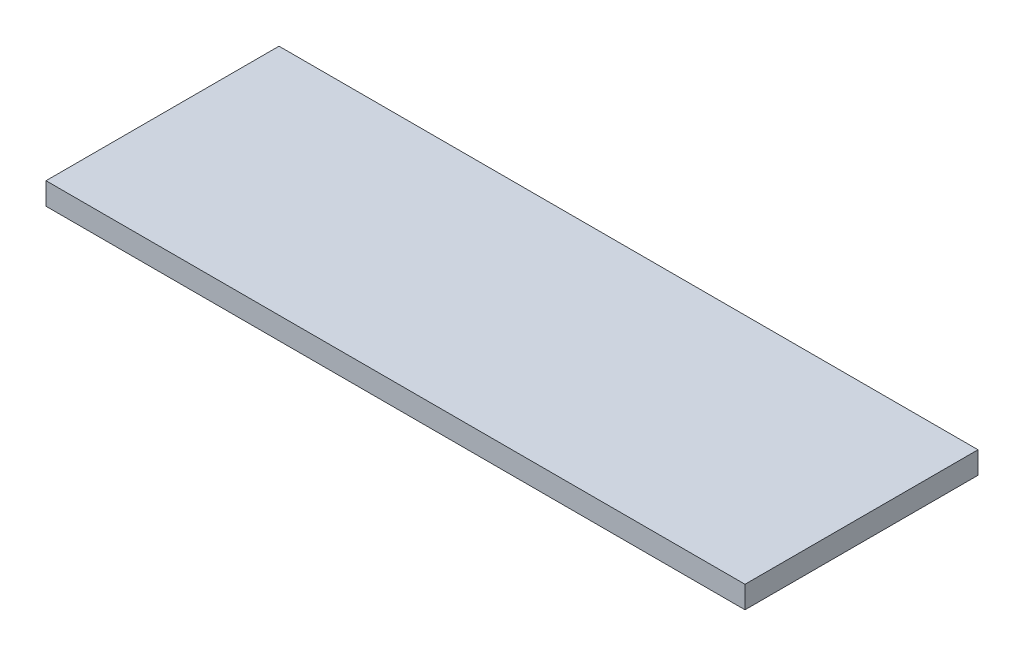
ISO-10303-21;
HEADER;
FILE_DESCRIPTION(('STEP AP214'),'2;1');
FILE_NAME('part.step','',(''),(''),'','','');
FILE_SCHEMA(('AUTOMOTIVE_DESIGN { 1 0 10303 214 1 1 1 1 }'));
ENDSEC;
DATA;
#1=APPLICATION_CONTEXT('core data for automotive mechanical design processes');
#2=APPLICATION_PROTOCOL_DEFINITION('international standard','automotive_design',2000,#1);
#3=PRODUCT_CONTEXT('',#1,'mechanical');
#4=PRODUCT('Part','Part','',(#3));
#5=PRODUCT_RELATED_PRODUCT_CATEGORY('part','',(#4));
#6=PRODUCT_DEFINITION_FORMATION('','',#4);
#7=PRODUCT_DEFINITION_CONTEXT('part definition',#1,'design');
#8=PRODUCT_DEFINITION('design','',#6,#7);
#9=PRODUCT_DEFINITION_SHAPE('','',#8);
#10=(LENGTH_UNIT() NAMED_UNIT(*) SI_UNIT(.MILLI.,.METRE.));
#11=(NAMED_UNIT(*) PLANE_ANGLE_UNIT() SI_UNIT($,.RADIAN.));
#12=(NAMED_UNIT(*) SI_UNIT($,.STERADIAN.) SOLID_ANGLE_UNIT());
#13=UNCERTAINTY_MEASURE_WITH_UNIT(LENGTH_MEASURE(1.E-05),#10,'distance_accuracy_value','');
#14=(GEOMETRIC_REPRESENTATION_CONTEXT(3) GLOBAL_UNCERTAINTY_ASSIGNED_CONTEXT((#13)) GLOBAL_UNIT_ASSIGNED_CONTEXT((#10,
#11,#12)) REPRESENTATION_CONTEXT('',''));
#15=CARTESIAN_POINT('',(0.,0.,0.));
#16=DIRECTION('',(0.,0.,1.));
#17=DIRECTION('',(1.,0.,0.));
#18=AXIS2_PLACEMENT_3D('',#15,#16,#17);
#19=CARTESIAN_POINT('',(-30.,1.9,-10.));
#20=DIRECTION('',(1.,0.,0.));
#21=DIRECTION('',(0.,0.,-1.));
#22=AXIS2_PLACEMENT_3D('',#19,#20,#21);
#23=PLANE('',#22);
#24=DIRECTION('',(0.,0.,1.));
#25=VECTOR('',#24,1.);
#26=CARTESIAN_POINT('',(-30.,0.,-10.));
#27=LINE('',#26,#25);
#28=CARTESIAN_POINT('',(-30.,0.,-10.));
#29=VERTEX_POINT('',#28);
#30=CARTESIAN_POINT('',(-30.,0.,10.));
#31=VERTEX_POINT('',#30);
#32=EDGE_CURVE('E96',#29,#31,#27,.T.);
#33=ORIENTED_EDGE('',*,*,#32,.T.);
#34=DIRECTION('',(0.,-1.,0.));
#35=VECTOR('',#34,1.);
#36=CARTESIAN_POINT('',(-30.,1.9,10.));
#37=LINE('',#36,#35);
#38=CARTESIAN_POINT('',(-30.,1.9,10.));
#39=VERTEX_POINT('',#38);
#40=EDGE_CURVE('E11',#39,#31,#37,.T.);
#41=ORIENTED_EDGE('',*,*,#40,.F.);
#42=DIRECTION('',(0.,0.,1.));
#43=VECTOR('',#42,1.);
#44=CARTESIAN_POINT('',(-30.,1.9,-10.));
#45=LINE('',#44,#43);
#46=CARTESIAN_POINT('',(-30.,1.9,-10.));
#47=VERTEX_POINT('',#46);
#48=EDGE_CURVE('E84',#47,#39,#45,.T.);
#49=ORIENTED_EDGE('',*,*,#48,.F.);
#50=DIRECTION('',(0.,-1.,0.));
#51=VECTOR('',#50,1.);
#52=CARTESIAN_POINT('',(-30.,1.9,-10.));
#53=LINE('',#52,#51);
#54=EDGE_CURVE('E92',#47,#29,#53,.T.);
#55=ORIENTED_EDGE('',*,*,#54,.T.);
#56=EDGE_LOOP('',(#33,#41,#49,#55));
#57=FACE_BOUND('',#56,.T.);
#58=ADVANCED_FACE('F33',(#57),#23,.F.);
#59=CARTESIAN_POINT('',(-30.,1.9,10.));
#60=DIRECTION('',(0.,0.,-1.));
#61=DIRECTION('',(-1.,0.,0.));
#62=AXIS2_PLACEMENT_3D('',#59,#60,#61);
#63=PLANE('',#62);
#64=DIRECTION('',(1.,0.,0.));
#65=VECTOR('',#64,1.);
#66=CARTESIAN_POINT('',(-30.,0.,10.));
#67=LINE('',#66,#65);
#68=CARTESIAN_POINT('',(30.,0.,10.));
#69=VERTEX_POINT('',#68);
#70=EDGE_CURVE('E88',#31,#69,#67,.T.);
#71=ORIENTED_EDGE('',*,*,#70,.T.);
#72=DIRECTION('',(0.,-1.,0.));
#73=VECTOR('',#72,1.);
#74=CARTESIAN_POINT('',(30.,1.9,10.));
#75=LINE('',#74,#73);
#76=CARTESIAN_POINT('',(30.,1.9,10.));
#77=VERTEX_POINT('',#76);
#78=EDGE_CURVE('E41',#77,#69,#75,.T.);
#79=ORIENTED_EDGE('',*,*,#78,.F.);
#80=DIRECTION('',(1.,0.,0.));
#81=VECTOR('',#80,1.);
#82=CARTESIAN_POINT('',(-30.,1.9,10.));
#83=LINE('',#82,#81);
#84=EDGE_CURVE('E79',#39,#77,#83,.T.);
#85=ORIENTED_EDGE('',*,*,#84,.F.);
#86=ORIENTED_EDGE('',*,*,#40,.T.);
#87=EDGE_LOOP('',(#71,#79,#85,#86));
#88=FACE_BOUND('',#87,.T.);
#89=ADVANCED_FACE('F87',(#88),#63,.F.);
#90=CARTESIAN_POINT('',(30.,1.9,-10.));
#91=DIRECTION('',(-1.,0.,0.));
#92=DIRECTION('',(0.,0.,1.));
#93=AXIS2_PLACEMENT_3D('',#90,#91,#92);
#94=PLANE('',#93);
#95=DIRECTION('',(0.,0.,-1.));
#96=VECTOR('',#95,1.);
#97=CARTESIAN_POINT('',(30.,0.,-10.));
#98=LINE('',#97,#96);
#99=CARTESIAN_POINT('',(30.,0.,-10.));
#100=VERTEX_POINT('',#99);
#101=EDGE_CURVE('E66',#69,#100,#98,.T.);
#102=ORIENTED_EDGE('',*,*,#101,.T.);
#103=DIRECTION('',(0.,-1.,0.));
#104=VECTOR('',#103,1.);
#105=CARTESIAN_POINT('',(30.,1.9,-10.));
#106=LINE('',#105,#104);
#107=CARTESIAN_POINT('',(30.,1.9,-10.));
#108=VERTEX_POINT('',#107);
#109=EDGE_CURVE('E89',#108,#100,#106,.T.);
#110=ORIENTED_EDGE('',*,*,#109,.F.);
#111=DIRECTION('',(0.,0.,-1.));
#112=VECTOR('',#111,1.);
#113=CARTESIAN_POINT('',(30.,1.9,-10.));
#114=LINE('',#113,#112);
#115=EDGE_CURVE('E82',#77,#108,#114,.T.);
#116=ORIENTED_EDGE('',*,*,#115,.F.);
#117=ORIENTED_EDGE('',*,*,#78,.T.);
#118=EDGE_LOOP('',(#102,#110,#116,#117));
#119=FACE_BOUND('',#118,.T.);
#120=ADVANCED_FACE('F90',(#119),#94,.F.);
#121=CARTESIAN_POINT('',(-30.,1.9,-10.));
#122=DIRECTION('',(0.,0.,1.));
#123=DIRECTION('',(1.,0.,0.));
#124=AXIS2_PLACEMENT_3D('',#121,#122,#123);
#125=PLANE('',#124);
#126=DIRECTION('',(-1.,0.,0.));
#127=VECTOR('',#126,1.);
#128=CARTESIAN_POINT('',(-30.,0.,-10.));
#129=LINE('',#128,#127);
#130=EDGE_CURVE('E72',#100,#29,#129,.T.);
#131=ORIENTED_EDGE('',*,*,#130,.T.);
#132=ORIENTED_EDGE('',*,*,#54,.F.);
#133=DIRECTION('',(-1.,0.,0.));
#134=VECTOR('',#133,1.);
#135=CARTESIAN_POINT('',(-30.,1.9,-10.));
#136=LINE('',#135,#134);
#137=EDGE_CURVE('E49',#108,#47,#136,.T.);
#138=ORIENTED_EDGE('',*,*,#137,.F.);
#139=ORIENTED_EDGE('',*,*,#109,.T.);
#140=EDGE_LOOP('',(#131,#132,#138,#139));
#141=FACE_BOUND('',#140,.T.);
#142=ADVANCED_FACE('F103',(#141),#125,.F.);
#143=CARTESIAN_POINT('',(0.,1.9,0.));
#144=DIRECTION('',(0.,1.,0.));
#145=DIRECTION('',(0.,0.,1.));
#146=AXIS2_PLACEMENT_3D('',#143,#144,#145);
#147=PLANE('',#146);
#148=ORIENTED_EDGE('',*,*,#48,.T.);
#149=ORIENTED_EDGE('',*,*,#84,.T.);
#150=ORIENTED_EDGE('',*,*,#115,.T.);
#151=ORIENTED_EDGE('',*,*,#137,.T.);
#152=EDGE_LOOP('',(#148,#149,#150,#151));
#153=FACE_BOUND('',#152,.T.);
#154=ADVANCED_FACE('F80',(#153),#147,.T.);
#155=CARTESIAN_POINT('',(0.,0.,0.));
#156=DIRECTION('',(0.,1.,0.));
#157=DIRECTION('',(0.,0.,1.));
#158=AXIS2_PLACEMENT_3D('',#155,#156,#157);
#159=PLANE('',#158);
#160=ORIENTED_EDGE('',*,*,#32,.F.);
#161=ORIENTED_EDGE('',*,*,#130,.F.);
#162=ORIENTED_EDGE('',*,*,#101,.F.);
#163=ORIENTED_EDGE('',*,*,#70,.F.);
#164=EDGE_LOOP('',(#160,#161,#162,#163));
#165=FACE_BOUND('',#164,.T.);
#166=ADVANCED_FACE('F106',(#165),#159,.F.);
#167=CLOSED_SHELL('',(#58,#89,#120,#142,#154,#166));
#168=MANIFOLD_SOLID_BREP('B2',#167);
#169=ADVANCED_BREP_SHAPE_REPRESENTATION('',(#18,#168),#14);
#170=SHAPE_DEFINITION_REPRESENTATION(#9,#169);
ENDSEC;
END-ISO-10303-21;
